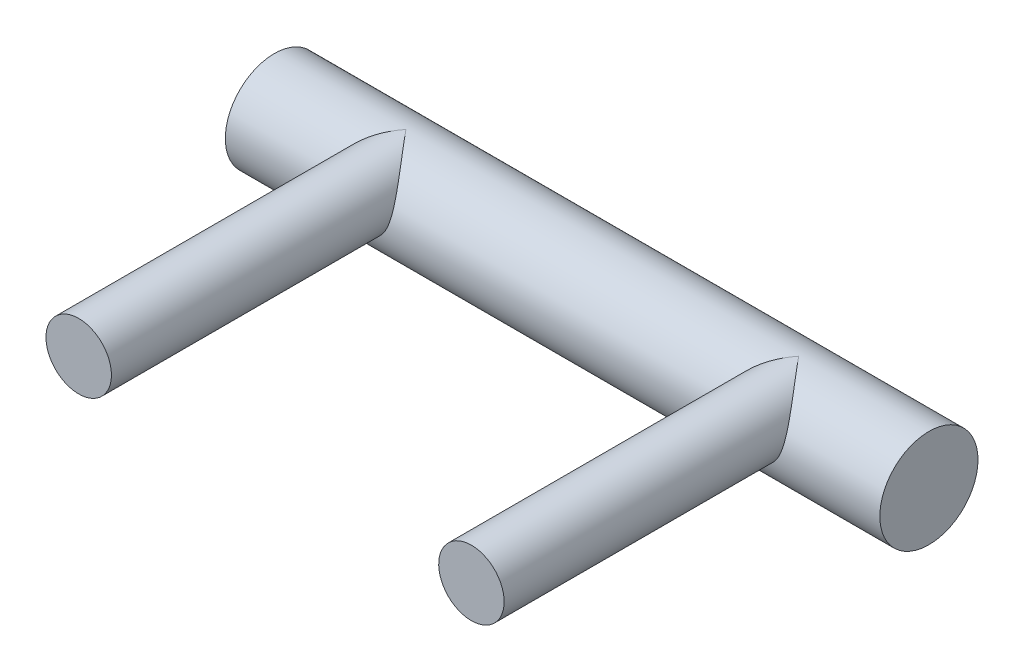
ISO-10303-21;
HEADER;
FILE_DESCRIPTION(('STEP AP214'),'2;1');
FILE_NAME('part.step','',(''),(''),'','','');
FILE_SCHEMA(('AUTOMOTIVE_DESIGN { 1 0 10303 214 1 1 1 1 }'));
ENDSEC;
DATA;
#1=APPLICATION_CONTEXT('core data for automotive mechanical design processes');
#2=APPLICATION_PROTOCOL_DEFINITION('international standard','automotive_design',2000,#1);
#3=PRODUCT_CONTEXT('',#1,'mechanical');
#4=PRODUCT('Part','Part','',(#3));
#5=PRODUCT_RELATED_PRODUCT_CATEGORY('part','',(#4));
#6=PRODUCT_DEFINITION_FORMATION('','',#4);
#7=PRODUCT_DEFINITION_CONTEXT('part definition',#1,'design');
#8=PRODUCT_DEFINITION('design','',#6,#7);
#9=PRODUCT_DEFINITION_SHAPE('','',#8);
#10=(LENGTH_UNIT() NAMED_UNIT(*) SI_UNIT(.MILLI.,.METRE.));
#11=(NAMED_UNIT(*) PLANE_ANGLE_UNIT() SI_UNIT($,.RADIAN.));
#12=(NAMED_UNIT(*) SI_UNIT($,.STERADIAN.) SOLID_ANGLE_UNIT());
#13=UNCERTAINTY_MEASURE_WITH_UNIT(LENGTH_MEASURE(1.E-05),#10,'distance_accuracy_value','');
#14=(GEOMETRIC_REPRESENTATION_CONTEXT(3) GLOBAL_UNCERTAINTY_ASSIGNED_CONTEXT((#13)) GLOBAL_UNIT_ASSIGNED_CONTEXT((#10,
#11,#12)) REPRESENTATION_CONTEXT('',''));
#15=CARTESIAN_POINT('',(0.,0.,0.));
#16=DIRECTION('',(0.,0.,1.));
#17=DIRECTION('',(1.,0.,0.));
#18=AXIS2_PLACEMENT_3D('',#15,#16,#17);
#19=CARTESIAN_POINT('',(63.5,0.,0.));
#20=DIRECTION('',(-1.,0.,0.));
#21=DIRECTION('',(0.,0.,1.));
#22=AXIS2_PLACEMENT_3D('',#19,#20,#21);
#23=CYLINDRICAL_SURFACE('',#22,9.525);
#24=CARTESIAN_POINT('',(-37.9674778593469,9.525,0.));
#25=CARTESIAN_POINT('',(-37.9677031199375,9.525,-4.75416934488494E-10));
#26=CARTESIAN_POINT('',(-37.9679283805299,9.52499998801613,0.000460241963717848));
#27=CARTESIAN_POINT('',(-37.968512491138,9.52499992587979,0.0014127522257268));
#28=CARTESIAN_POINT('',(-37.9688713459761,9.52499985730727,0.00176216329356708));
#29=CARTESIAN_POINT('',(-37.9701660853451,9.52499950010016,0.00314680505368922));
#30=CARTESIAN_POINT('',(-37.9711018599747,9.52499903491133,0.00438130152707296));
#31=CARTESIAN_POINT('',(-37.9746325799953,9.52499649926848,0.00892124826608614));
#32=CARTESIAN_POINT('',(-37.9772277406224,9.52499304501016,0.0120180190040743));
#33=CARTESIAN_POINT('',(-38.0527332341124,9.52484626134367,0.102255610762584));
#34=CARTESIAN_POINT('',(-38.1256407454377,9.52344890963461,0.193129117783091));
#35=CARTESIAN_POINT('',(-38.2720939081958,9.51811664110121,0.373693867235561));
#36=CARTESIAN_POINT('',(-38.3456390910922,9.51415790940293,0.463365868582594));
#37=CARTESIAN_POINT('',(-38.4906110968279,9.50382031799043,0.640726372479592));
#38=CARTESIAN_POINT('',(-38.5620406482669,9.49751087906986,0.728401748014186));
#39=CARTESIAN_POINT('',(-38.7045803559744,9.48247992058577,0.903299500007271));
#40=CARTESIAN_POINT('',(-38.7756908642776,9.4737644718588,0.99052246099952));
#41=CARTESIAN_POINT('',(-38.9233676164294,9.45311804671628,1.1718056489948));
#42=CARTESIAN_POINT('',(-38.9999185489236,9.44098664297923,1.26585864103564));
#43=CARTESIAN_POINT('',(-39.1527951448609,9.41387439552527,1.45383164494936));
#44=CARTESIAN_POINT('',(-39.2291206146444,9.39889157627007,1.5477515188745));
#45=CARTESIAN_POINT('',(-39.4585349133646,9.34944965457681,1.83033816690355));
#46=CARTESIAN_POINT('',(-39.611120517491,9.31062783644083,2.01867743973967));
#47=CARTESIAN_POINT('',(-39.8876603289078,9.22911895477531,2.36098516145364));
#48=CARTESIAN_POINT('',(-40.0119207755654,9.18831918476809,2.51516073799232));
#49=CARTESIAN_POINT('',(-40.2586456809145,9.09870220153422,2.82219337137813));
#50=CARTESIAN_POINT('',(-40.3811127273129,9.04989810888913,2.97505216214459));
#51=CARTESIAN_POINT('',(-40.6222910682105,8.94487917678854,3.27718713796029));
#52=CARTESIAN_POINT('',(-40.7410311426245,8.88878634380385,3.42648268416618));
#53=CARTESIAN_POINT('',(-40.9763101924549,8.76846869938415,3.72361132605213));
#54=CARTESIAN_POINT('',(-41.0928483938452,8.70424108727112,3.87144389906444));
#55=CARTESIAN_POINT('',(-41.3762685039006,8.5360543828857,4.23289238116289));
#56=CARTESIAN_POINT('',(-41.5416696241943,8.42740236735799,4.44551267522983));
#57=CARTESIAN_POINT('',(-41.8659964895574,8.19141449997597,4.86670653678669));
#58=CARTESIAN_POINT('',(-42.0248974148968,8.06401428115575,5.07526324202014));
#59=CARTESIAN_POINT('',(-42.3390627762702,7.78556106638311,5.49325273817715));
#60=CARTESIAN_POINT('',(-42.4940270631957,7.63385867713034,5.70248082506855));
#61=CARTESIAN_POINT('',(-42.7920605626346,7.30953018531255,6.11266324720032));
#62=CARTESIAN_POINT('',(-42.9351433310932,7.13692849601166,6.31362687561987));
#63=CARTESIAN_POINT('',(-43.1700470878032,6.81965588588304,6.65254062972961));
#64=CARTESIAN_POINT('',(-43.2652789435155,6.68002400947138,6.79285576386408));
#65=CARTESIAN_POINT('',(-43.4466758487381,6.3890749610151,7.06720022804113));
#66=CARTESIAN_POINT('',(-43.5328398002827,6.2377563777507,7.20122879580321));
#67=CARTESIAN_POINT('',(-43.6939315057964,5.9247218087018,7.46085246642879));
#68=CARTESIAN_POINT('',(-43.7689424466775,5.76309714527614,7.58650569999581));
#69=CARTESIAN_POINT('',(-43.9068480319816,5.42867930084521,7.82928620314386));
#70=CARTESIAN_POINT('',(-43.969746756129,5.25588990670729,7.9464163352384));
#71=CARTESIAN_POINT('',(-44.070133777866,4.93627878149907,8.14780798478716));
#72=CARTESIAN_POINT('',(-44.1101878334721,4.79140216306502,8.23388280595801));
#73=CARTESIAN_POINT('',(-44.1805142213027,4.49552352430728,8.39908179144671));
#74=CARTESIAN_POINT('',(-44.2107920155309,4.34452497757516,8.47820981888629));
#75=CARTESIAN_POINT('',(-44.2606460150991,4.03688125024541,8.62893867724202));
#76=CARTESIAN_POINT('',(-44.2802110566907,3.88023035980107,8.70053159332605));
#77=CARTESIAN_POINT('',(-44.3076575297386,3.56237934259525,8.83543318816502));
#78=CARTESIAN_POINT('',(-44.3155388537062,3.40117917399483,8.89874179070033));
#79=CARTESIAN_POINT('',(-44.3187967226575,3.07432930948008,9.01690196499753));
#80=CARTESIAN_POINT('',(-44.314088255211,2.90865687964205,9.07169338558436));
#81=CARTESIAN_POINT('',(-44.2913099511221,2.57538286275414,9.17187556634454));
#82=CARTESIAN_POINT('',(-44.2732400313009,2.40778126370104,9.21726626799354));
#83=CARTESIAN_POINT('',(-44.2233139816056,2.0723929945541,9.2984173171072));
#84=CARTESIAN_POINT('',(-44.191465455907,1.90460647738505,9.33418295884265));
#85=CARTESIAN_POINT('',(-44.1138200637838,1.57051254830925,9.39616801915291));
#86=CARTESIAN_POINT('',(-44.0680245735333,1.4042049921361,9.42238837901912));
#87=CARTESIAN_POINT('',(-43.96872783847,1.09392334163201,9.46311455506781));
#88=CARTESIAN_POINT('',(-43.916734997348,0.949594904890621,9.47862591824138));
#89=CARTESIAN_POINT('',(-43.8021804916295,0.664553309762203,9.50286573922852));
#90=CARTESIAN_POINT('',(-43.7396153269056,0.523841366502308,9.51159194533669));
#91=CARTESIAN_POINT('',(-43.604334984364,0.247194358010774,9.52279808823065));
#92=CARTESIAN_POINT('',(-43.5316231494553,0.111257737895894,9.52528007712441));
#93=CARTESIAN_POINT('',(-43.3764833960171,-0.155001628439416,9.52466969913397));
#94=CARTESIAN_POINT('',(-43.294051662395,-0.285322142731831,9.52157513658254));
#95=CARTESIAN_POINT('',(-43.1188422457189,-0.541224088546936,9.51048529958243));
#96=CARTESIAN_POINT('',(-43.025938072437,-0.666715906164841,9.50242333376738));
#97=CARTESIAN_POINT('',(-42.8312938845863,-0.910353808090843,9.48218493506996));
#98=CARTESIAN_POINT('',(-42.7295509250298,-1.02849742138444,9.47000712689698));
#99=CARTESIAN_POINT('',(-42.5178475973631,-1.25680274877878,9.44242008764053));
#100=CARTESIAN_POINT('',(-42.4078858134463,-1.36696308118135,9.42701029897401));
#101=CARTESIAN_POINT('',(-42.1803643306365,-1.578761505321,9.39386127122602));
#102=CARTESIAN_POINT('',(-42.06280406501,-1.68039896007663,9.37612185828727));
#103=CARTESIAN_POINT('',(-41.808119611665,-1.88477484138938,9.33729956455353));
#104=CARTESIAN_POINT('',(-41.6702312250107,-1.98653291611692,9.31606075634341));
#105=CARTESIAN_POINT('',(-41.3867854178453,-2.17851573774404,9.27304545432448));
#106=CARTESIAN_POINT('',(-41.2412299694837,-2.2687434302694,9.25126909954376));
#107=CARTESIAN_POINT('',(-40.9431416683947,-2.43724140502903,9.20831396074305));
#108=CARTESIAN_POINT('',(-40.7906043995569,-2.5155039794451,9.18713556902662));
#109=CARTESIAN_POINT('',(-40.4795695787596,-2.65948826028936,9.1464935130593));
#110=CARTESIAN_POINT('',(-40.3210742628921,-2.72521461648232,9.1270292144877));
#111=CARTESIAN_POINT('',(-39.9911157412223,-2.84660949142771,9.08992129650359));
#112=CARTESIAN_POINT('',(-39.8193974902322,-2.90162843803785,9.07241338219162));
#113=CARTESIAN_POINT('',(-39.4715565401396,-2.99693373602886,9.0413787188838));
#114=CARTESIAN_POINT('',(-39.2954336971421,-3.03721960541674,9.02785210013896));
#115=CARTESIAN_POINT('',(-38.940180506636,-3.10265511550174,9.00557348703849));
#116=CARTESIAN_POINT('',(-38.7610516191452,-3.12781189741453,8.99681924021575));
#117=CARTESIAN_POINT('',(-38.4011256397321,-3.16275483401868,8.98459533714581));
#118=CARTESIAN_POINT('',(-38.220328646131,-3.17254188888172,8.98112537141006));
#119=CARTESIAN_POINT('',(-37.8675245530489,-3.17654085579392,8.97971115792246));
#120=CARTESIAN_POINT('',(-37.695526521506,-3.17150162763026,8.98150122561361));
#121=CARTESIAN_POINT('',(-37.3526299186839,-3.14749940006459,8.98994073141029));
#122=CARTESIAN_POINT('',(-37.1817313153591,-3.12853680836552,8.99659002722823));
#123=CARTESIAN_POINT('',(-36.8422452270945,-3.07686675301419,9.01439180718626));
#124=CARTESIAN_POINT('',(-36.6736580505583,-3.04415747328067,9.02554488631562));
#125=CARTESIAN_POINT('',(-36.3399739232359,-2.96528699552789,9.05176346360209));
#126=CARTESIAN_POINT('',(-36.1748770316861,-2.91912556939793,9.06682902810352));
#127=CARTESIAN_POINT('',(-35.8505567020387,-2.81415377513675,9.09995407242145));
#128=CARTESIAN_POINT('',(-35.691296618543,-2.75544848416246,9.11798841166336));
#129=CARTESIAN_POINT('',(-35.3781502100257,-2.62557121768043,9.15623187182653));
#130=CARTESIAN_POINT('',(-35.2242658670408,-2.55439470101738,9.17644178390325));
#131=CARTESIAN_POINT('',(-34.9227690043688,-2.40002798513807,9.21801922625434));
#132=CARTESIAN_POINT('',(-34.7751578447059,-2.3168351978213,9.23938700529249));
#133=CARTESIAN_POINT('',(-34.4870578879431,-2.13892905459141,9.28218595515806));
#134=CARTESIAN_POINT('',(-34.3465692402083,-2.04421545721862,9.30361712730491));
#135=CARTESIAN_POINT('',(-34.0657822861678,-1.83811162004883,9.34658581027181));
#136=CARTESIAN_POINT('',(-33.9259432458971,-1.72608148573088,9.36806091025549));
#137=CARTESIAN_POINT('',(-33.6560846160064,-1.49045374009449,9.40842441443587));
#138=CARTESIAN_POINT('',(-33.5260604288301,-1.36686160626884,9.42731403316044));
#139=CARTESIAN_POINT('',(-33.276646344916,-1.10878450091816,9.46113948618486));
#140=CARTESIAN_POINT('',(-33.1572598459438,-0.974296075029734,9.47607406019321));
#141=CARTESIAN_POINT('',(-32.9301649818378,-0.695438045650404,9.50060868418107));
#142=CARTESIAN_POINT('',(-32.8224506319272,-0.551073568545289,9.51021147849318));
#143=CARTESIAN_POINT('',(-32.6225711826926,-0.257928835034865,9.52260320830493));
#144=CARTESIAN_POINT('',(-32.53003908865,-0.109407347731918,9.5255861784502));
#145=CARTESIAN_POINT('',(-32.3575584743289,0.194754302308815,9.52422263681127));
#146=CARTESIAN_POINT('',(-32.2776097692481,0.350394360458457,9.51987623267876));
#147=CARTESIAN_POINT('',(-32.1310319141729,0.667243612925545,9.50292358697095));
#148=CARTESIAN_POINT('',(-32.0643916826614,0.828448041676449,9.49032425506496));
#149=CARTESIAN_POINT('',(-31.9448475696099,1.15494151492412,9.45614417233764));
#150=CARTESIAN_POINT('',(-31.8919422388936,1.32023012647961,9.43456436967627));
#151=CARTESIAN_POINT('',(-31.8049357524065,1.63568988210337,9.38471687517149));
#152=CARTESIAN_POINT('',(-31.769444363629,1.78562840222094,9.35738798290716));
#153=CARTESIAN_POINT('',(-31.7096563944935,2.08613085045369,9.29501079821229));
#154=CARTESIAN_POINT('',(-31.6853596842959,2.23669477129484,9.2599625953198));
#155=CARTESIAN_POINT('',(-31.6477730882122,2.5372156248085,9.18217067443809));
#156=CARTESIAN_POINT('',(-31.6344843515332,2.68717249248026,9.13942615353791));
#157=CARTESIAN_POINT('',(-31.6185563117572,2.98530959051245,9.04643228147217));
#158=CARTESIAN_POINT('',(-31.6159173232338,3.1334897682639,8.99618270866699));
#159=CARTESIAN_POINT('',(-31.6207465042027,3.42480783495049,8.88932086381099));
#160=CARTESIAN_POINT('',(-31.6280620293142,3.56798811082996,8.83281661966096));
#161=CARTESIAN_POINT('',(-31.6519481142557,3.85082080306043,8.7132306361493));
#162=CARTESIAN_POINT('',(-31.6685213640756,3.99047218169689,8.65014698936494));
#163=CARTESIAN_POINT('',(-31.7102513432048,4.26537886247744,8.51794619421509));
#164=CARTESIAN_POINT('',(-31.7353991401472,4.4006385795973,8.4488353800687));
#165=CARTESIAN_POINT('',(-31.7936029864652,4.66640309741699,8.30500761885473));
#166=CARTESIAN_POINT('',(-31.8266606657813,4.79690691170216,8.2302895185093));
#167=CARTESIAN_POINT('',(-31.9157245085981,5.10759314104069,8.04261635319679));
#168=CARTESIAN_POINT('',(-31.9754942997837,5.28510070394803,7.92699592135313));
#169=CARTESIAN_POINT('',(-32.1078509409179,5.62881527727659,7.6867460376059));
#170=CARTESIAN_POINT('',(-32.1804389412979,5.79502127152861,7.5621157776658));
#171=CARTESIAN_POINT('',(-32.3373420295419,6.11718360354659,7.30401613549085));
#172=CARTESIAN_POINT('',(-32.4217521995818,6.27304000439363,7.17048021154618));
#173=CARTESIAN_POINT('',(-32.6001903191446,6.57281582091127,6.89673302042319));
#174=CARTESIAN_POINT('',(-32.6942169634832,6.71673685170664,6.75652266050177));
#175=CARTESIAN_POINT('',(-32.9304515963568,7.04897170540672,6.41216398594008));
#176=CARTESIAN_POINT('',(-33.0766983003425,7.23152412718562,6.20521096813104));
#177=CARTESIAN_POINT('',(-33.3823485389206,7.57407467014179,5.78214672406567));
#178=CARTESIAN_POINT('',(-33.5417681889135,7.73404449689834,5.56602444240974));
#179=CARTESIAN_POINT('',(-33.8655943638158,8.02713012348862,5.13387976050869));
#180=CARTESIAN_POINT('',(-34.0296683794257,8.16095190179225,4.91808425638135));
#181=CARTESIAN_POINT('',(-34.364959338867,8.40831686935109,4.48201325413232));
#182=CARTESIAN_POINT('',(-34.5361485111476,8.52193116615222,4.26175663040893));
#183=CARTESIAN_POINT('',(-34.8260693611703,8.69516446399503,3.89182645759482));
#184=CARTESIAN_POINT('',(-34.9431127372488,8.7601037664365,3.74328755635217));
#185=CARTESIAN_POINT('',(-35.179441853553,8.88175140254742,3.44471955355553));
#186=CARTESIAN_POINT('',(-35.2987267921227,8.93846261787193,3.29469099347606));
#187=CARTESIAN_POINT('',(-35.5410421319636,9.04463995801146,2.99104903289555));
#188=CARTESIAN_POINT('',(-35.6641019117777,9.09398228393092,2.83741586813364));
#189=CARTESIAN_POINT('',(-35.9120408457891,9.18458634843749,2.52881454292338));
#190=CARTESIAN_POINT('',(-36.0369226347463,9.22583480701117,2.37384461689259));
#191=CARTESIAN_POINT('',(-36.3148965731032,9.30824988375212,2.0297193933241));
#192=CARTESIAN_POINT('',(-36.468300576262,9.34750570589825,1.84035316776047));
#193=CARTESIAN_POINT('',(-36.6989571776509,9.39749894303692,1.55621786478772));
#194=CARTESIAN_POINT('',(-36.7756979752351,9.41264856830879,1.46178190815516));
#195=CARTESIAN_POINT('',(-36.9294096483946,9.44006223781837,1.27277386818249));
#196=CARTESIAN_POINT('',(-37.0063803269826,9.45232828034803,1.17820192507758));
#197=CARTESIAN_POINT('',(-37.154867979943,9.47320331227452,0.995918399526424));
#198=CARTESIAN_POINT('',(-37.2263693822915,9.48201502165478,0.908214208075952));
#199=CARTESIAN_POINT('',(-37.369694226288,9.49721171437121,0.732350395081152));
#200=CARTESIAN_POINT('',(-37.4415180258964,9.5035905583668,0.644190182997728));
#201=CARTESIAN_POINT('',(-37.5872911643054,9.51404152518121,0.465848393490937));
#202=CARTESIAN_POINT('',(-37.6612432766971,9.51804345731821,0.375679997876584));
#203=CARTESIAN_POINT('',(-37.8085072435005,9.52343339133709,0.194115069426546));
#204=CARTESIAN_POINT('',(-37.8818186214001,9.52484547623986,0.102737893964407));
#205=CARTESIAN_POINT('',(-37.9577279876668,9.52499304502841,0.0120180209483089));
#206=CARTESIAN_POINT('',(-37.960323157846,9.52499649929391,0.00892122696195135));
#207=CARTESIAN_POINT('',(-37.9638538807641,9.52499903492295,0.00438127437096119));
#208=CARTESIAN_POINT('',(-37.9647896487298,9.52499950010569,0.00314678780104024));
#209=CARTESIAN_POINT('',(-37.9660843792699,9.52499985730858,0.00176215473005573));
#210=CARTESIAN_POINT('',(-37.9664432319394,9.52499992588038,0.00141274535820088));
#211=CARTESIAN_POINT('',(-37.9670273396372,9.52499998801621,0.000460240862629553));
#212=CARTESIAN_POINT('',(-37.9672525994912,9.525,4.75415383609733E-10));
#213=CARTESIAN_POINT('',(-37.9674778593469,9.525,0.));
#214=B_SPLINE_CURVE_WITH_KNOTS('',3,(#24,#25,#26,#27,#28,#29,#30,#31,#32,#33,#34,#35,#36,#37,
#38,#39,#40,#41,#42,#43,#44,#45,#46,#47,#48,#49,#50,#51,#52,#53,#54,#55,#56,#57,#58,#59,#60,#61,
#62,#63,#64,#65,#66,#67,#68,#69,#70,#71,#72,#73,#74,#75,#76,#77,#78,#79,#80,#81,#82,#83,#84,#85,
#86,#87,#88,#89,#90,#91,#92,#93,#94,#95,#96,#97,#98,#99,#100,#101,#102,#103,#104,#105,#106,#107,
#108,#109,#110,#111,#112,#113,#114,#115,#116,#117,#118,#119,#120,#121,#122,#123,#124,#125,#126,
#127,#128,#129,#130,#131,#132,#133,#134,#135,#136,#137,#138,#139,#140,#141,#142,#143,#144,#145,
#146,#147,#148,#149,#150,#151,#152,#153,#154,#155,#156,#157,#158,#159,#160,#161,#162,#163,#164,
#165,#166,#167,#168,#169,#170,#171,#172,#173,#174,#175,#176,#177,#178,#179,#180,#181,#182,#183,
#184,#185,#186,#187,#188,#189,#190,#191,#192,#193,#194,#195,#196,#197,#198,#199,#200,#201,#202,
#203,#204,#205,#206,#207,#208,#209,#210,#211,#212,#213),.UNSPECIFIED.,.T.,.F.,(4,2,2,2,2,2,2,2,
2,2,2,2,2,2,2,2,2,2,2,2,2,2,2,2,2,2,2,2,2,2,2,2,2,2,2,2,2,2,2,2,2,2,2,2,2,2,2,2,2,2,2,2,2,2,2,2,
2,2,2,2,2,2,2,2,2,2,2,2,2,2,2,2,2,2,2,2,2,2,2,2,2,2,2,2,2,2,2,2,2,2,2,2,2,2,4),(0.,
0.0010684445786857,0.00277048513944007,0.00720968890461657,0.0195192258966796,0.365352817847043,
0.714448983170463,1.05396174859267,1.39262556524059,1.7581903388497,2.12400931384526,
2.86012872378009,3.46650370549771,4.07189448114666,4.66821364932362,5.26473868185262,
6.13544910337681,7.00922180673471,7.91226590501852,8.81426511966578,9.47275648760449,
10.1313274958887,10.7847092330436,11.4378705070117,11.9570317624423,12.4759024582211,
12.9953128444747,13.5147280092145,14.0376593614348,14.5605939690768,15.0832403455215,
15.6058351681302,16.0678571257899,16.5300323435505,16.9920556515716,17.454260912741,
17.9228110962815,18.3915179988469,18.8603058295976,19.3291286653691,19.8466046684802,
20.3639482084315,20.8816236246397,21.3991066566867,21.941912761235,22.4847366221107,
23.0273040583334,23.5698397163689,24.0854503585695,24.6010459032977,25.1167095850126,
25.6323820114474,26.1438931948392,26.6555910236736,27.1673992283252,27.6792181615917,
28.2199560388132,28.7604390266046,29.3010940348812,29.8414705027869,30.3657862288072,
30.8900942538991,31.4139638682151,31.9377781862957,32.4066548616101,32.8755260986028,
33.3444462785072,33.8133803093293,34.2752040669017,34.7371620850976,35.1986403304315,
35.6602137517525,36.3195716336009,36.9789887227715,37.6440514971959,38.3090241262695,
39.2445390705475,40.1812159398612,41.0873259528276,41.9901815242384,42.589858822839,
43.1893255918041,43.7979424014946,44.4075495992874,45.1477593420358,45.5156117346539,
45.883208453063,46.2237489541326,46.5651432117884,46.9161735485131,47.263922770224,
47.2762323526127,47.280671524766,47.2823735550275,47.2834419961207),.UNSPECIFIED.);
#215=CARTESIAN_POINT('',(-37.9674778593469,9.525,0.));
#216=VERTEX_POINT('',#215);
#217=EDGE_CURVE('E46',#216,#216,#214,.T.);
#218=ORIENTED_EDGE('',*,*,#217,.F.);
#219=EDGE_LOOP('',(#218));
#220=FACE_BOUND('',#219,.T.);
#221=CARTESIAN_POINT('',(63.5,0.,0.));
#222=DIRECTION('',(1.,0.,0.));
#223=DIRECTION('',(0.,0.,-1.));
#224=AXIS2_PLACEMENT_3D('',#221,#222,#223);
#225=CIRCLE('',#224,9.525);
#226=CARTESIAN_POINT('',(63.5,0.,-9.525));
#227=VERTEX_POINT('',#226);
#228=EDGE_CURVE('E82',#227,#227,#225,.T.);
#229=ORIENTED_EDGE('',*,*,#228,.F.);
#230=EDGE_LOOP('',(#229));
#231=FACE_BOUND('',#230,.T.);
#232=CARTESIAN_POINT('',(-63.5,0.,0.));
#233=DIRECTION('',(1.,0.,0.));
#234=DIRECTION('',(0.,0.,-1.));
#235=AXIS2_PLACEMENT_3D('',#232,#233,#234);
#236=CIRCLE('',#235,9.525);
#237=CARTESIAN_POINT('',(-63.5,0.,-9.525));
#238=VERTEX_POINT('',#237);
#239=EDGE_CURVE('E85',#238,#238,#236,.T.);
#240=ORIENTED_EDGE('',*,*,#239,.T.);
#241=EDGE_LOOP('',(#240));
#242=FACE_BOUND('',#241,.T.);
#243=CARTESIAN_POINT('',(38.2325221406531,9.52500000000001,0.));
#244=CARTESIAN_POINT('',(38.2322968800301,9.52500000000001,-4.74981253360253E-10));
#245=CARTESIAN_POINT('',(38.2320716194059,9.52499998801614,0.000460241930443009));
#246=CARTESIAN_POINT('',(38.2314875087728,9.52499992587979,0.00141275215214757));
#247=CARTESIAN_POINT('',(38.2311286539715,9.52499985730728,0.00176216325558808));
#248=CARTESIAN_POINT('',(38.2298339146861,9.52499950010017,0.00314680509824516));
#249=CARTESIAN_POINT('',(38.2288981400297,9.52499903491133,0.00438130154005174));
#250=CARTESIAN_POINT('',(38.2253674199445,9.52499649926849,0.00892124820382223));
#251=CARTESIAN_POINT('',(38.2227722593465,9.52499304501016,0.0120180189723124));
#252=CARTESIAN_POINT('',(38.147266766608,9.52484626134357,0.102255611619715));
#253=CARTESIAN_POINT('',(38.0743592546984,9.52344890963333,0.193129118084086));
#254=CARTESIAN_POINT('',(37.9279060915339,9.51811664109768,0.373693867093356));
#255=CARTESIAN_POINT('',(37.854360908822,9.51415790940065,0.463365868562369));
#256=CARTESIAN_POINT('',(37.7093889032175,9.50382031798994,0.640726372545449));
#257=CARTESIAN_POINT('',(37.6379593517303,9.49751087906839,0.728401748050093));
#258=CARTESIAN_POINT('',(37.4954196439588,9.48247992057992,0.903299500056546));
#259=CARTESIAN_POINT('',(37.4243091356397,9.473764471849,0.990522461091928));
#260=CARTESIAN_POINT('',(37.27663238347,9.45311804670034,1.17180564912801));
#261=CARTESIAN_POINT('',(37.2000814509729,9.440986642962,1.26585864116542));
#262=CARTESIAN_POINT('',(37.0472048550386,9.41387439550634,1.45383164507031));
#263=CARTESIAN_POINT('',(36.9708793852609,9.39889157625091,1.54775151899006));
#264=CARTESIAN_POINT('',(36.7414650865645,9.34944965455907,1.83033816699278));
#265=CARTESIAN_POINT('',(36.588879482455,9.31062783642585,2.01867743980687));
#266=CARTESIAN_POINT('',(36.3123396710547,9.22911895476347,2.36098516149982));
#267=CARTESIAN_POINT('',(36.1880792243968,9.18831918475526,2.5151607380392));
#268=CARTESIAN_POINT('',(35.9413543190446,9.09870220151846,2.82219337142923));
#269=CARTESIAN_POINT('',(35.8188872726434,9.04989810887125,2.9750521621992));
#270=CARTESIAN_POINT('',(35.5777089317374,8.94487917676471,3.27718713802571));
#271=CARTESIAN_POINT('',(35.4589688573177,8.88878634377598,3.42648268423887));
#272=CARTESIAN_POINT('',(35.2236898074769,8.76846869934766,3.72361132613838));
#273=CARTESIAN_POINT('',(35.1071516060819,8.7042410872301,3.871443899157));
#274=CARTESIAN_POINT('',(34.8237314960248,8.53605438283822,4.23289238125851));
#275=CARTESIAN_POINT('',(34.658330375734,8.42740236730916,4.4455126753223));
#276=CARTESIAN_POINT('',(34.3340035103782,8.1914144999258,4.86670653687093));
#277=CARTESIAN_POINT('',(34.1751025850431,8.06401428110576,5.07526324209935));
#278=CARTESIAN_POINT('',(33.8609372236794,7.78556106633507,5.49325273824495));
#279=CARTESIAN_POINT('',(33.7059729367591,7.63385867708422,5.70248082512999));
#280=CARTESIAN_POINT('',(33.40793943733,7.30953018527092,6.11266324724985));
#281=CARTESIAN_POINT('',(33.2648566688758,7.13692849597256,6.31362687566382));
#282=CARTESIAN_POINT('',(33.0299529121711,6.81965588584631,6.65254062976726));
#283=CARTESIAN_POINT('',(32.9347210564597,6.68002400943403,6.79285576390081));
#284=CARTESIAN_POINT('',(32.7533241512394,6.38907496097665,7.06720022807588));
#285=CARTESIAN_POINT('',(32.6671601996959,6.23775637771179,7.20122879583691));
#286=CARTESIAN_POINT('',(32.5060684941843,5.92472180866167,7.46085246646066));
#287=CARTESIAN_POINT('',(32.4310575533043,5.76309714523523,7.58650570002689));
#288=CARTESIAN_POINT('',(32.2931519680023,5.42867930080279,7.82928620317328));
#289=CARTESIAN_POINT('',(32.2302532438561,5.25588990666415,7.94641633526693));
#290=CARTESIAN_POINT('',(32.1298662221213,4.93627878145517,8.14780798481374));
#291=CARTESIAN_POINT('',(32.0898121665164,4.79140216302111,8.23388280598355));
#292=CARTESIAN_POINT('',(32.019485778688,4.49552352426343,8.39908179147017));
#293=CARTESIAN_POINT('',(31.9892079844609,4.34452497753141,8.4782098189087));
#294=CARTESIAN_POINT('',(31.939353984895,4.03688125020206,8.62893867726228));
#295=CARTESIAN_POINT('',(31.9197889433045,3.88023035975804,8.70053159334523));
#296=CARTESIAN_POINT('',(31.8923424702588,3.56237934255298,8.83543318818204));
#297=CARTESIAN_POINT('',(31.8844611462924,3.40117917395303,8.8987417907163));
#298=CARTESIAN_POINT('',(31.8812032773432,3.07432930943933,9.01690196501141));
#299=CARTESIAN_POINT('',(31.8859117447907,2.9086568796019,9.07169338559722));
#300=CARTESIAN_POINT('',(31.9086900488816,2.57538286271533,9.17187556635542));
#301=CARTESIAN_POINT('',(31.9267599687038,2.40778126366298,9.21726626800346));
#302=CARTESIAN_POINT('',(31.9766860184009,2.07239299451763,9.29841731711531));
#303=CARTESIAN_POINT('',(32.0085345441003,1.90460647734941,9.3341829588499));
#304=CARTESIAN_POINT('',(32.0861799362251,1.57051254827541,9.39616801915854));
#305=CARTESIAN_POINT('',(32.1319754264763,1.40420499210321,9.422388379024));
#306=CARTESIAN_POINT('',(32.2312721615409,1.09392334160049,9.46311455507144));
#307=CARTESIAN_POINT('',(32.2832650026637,0.949594904859512,9.47862591824449));
#308=CARTESIAN_POINT('',(32.3978195083836,0.664553309731995,9.50286573923063));
#309=CARTESIAN_POINT('',(32.4603846731081,0.523841366472584,9.51159194533832));
#310=CARTESIAN_POINT('',(32.5956650156509,0.247194357982084,9.52279808823139));
#311=CARTESIAN_POINT('',(32.6683768505602,0.111257737867753,9.52528007712473));
#312=CARTESIAN_POINT('',(32.8235166039995,-0.155001628466414,9.52466969913352));
#313=CARTESIAN_POINT('',(32.9059483376222,-0.285322142758237,9.52157513658174));
#314=CARTESIAN_POINT('',(33.0811577542996,-0.541224088572463,9.51048529958097));
#315=CARTESIAN_POINT('',(33.1740619275822,-0.666715906190063,9.50242333376561));
#316=CARTESIAN_POINT('',(33.3687061154343,-0.910353808115393,9.4821849350676));
#317=CARTESIAN_POINT('',(33.4704490749915,-1.02849742140863,9.47000712689435));
#318=CARTESIAN_POINT('',(33.6821524026597,-1.25680274880217,9.44242008763741));
#319=CARTESIAN_POINT('',(33.7921141865772,-1.3669630812043,9.42701029897067));
#320=CARTESIAN_POINT('',(34.0196356693884,-1.57876150534304,9.39386127122231));
#321=CARTESIAN_POINT('',(34.1371959350156,-1.68039896009819,9.3761218582834));
#322=CARTESIAN_POINT('',(34.391880388362,-1.88477484140988,9.33729956454939));
#323=CARTESIAN_POINT('',(34.5297687750171,-1.98653291613685,9.31606075633916));
#324=CARTESIAN_POINT('',(34.813214582184,-2.17851573776274,9.27304545432008));
#325=CARTESIAN_POINT('',(34.9587700305464,-2.26874343028745,9.25126909953932));
#326=CARTESIAN_POINT('',(35.2568583316367,-2.43724140504569,9.20831396073863));
#327=CARTESIAN_POINT('',(35.4093956004752,-2.51550397946104,9.18713556902225));
#328=CARTESIAN_POINT('',(35.7204304212739,-2.65948826030378,9.1464935130551));
#329=CARTESIAN_POINT('',(35.8789257371421,-2.72521461649594,9.12702921448362));
#330=CARTESIAN_POINT('',(36.2088842588128,-2.8466094914395,9.08992129649989));
#331=CARTESIAN_POINT('',(36.3806025098032,-2.90162843804863,9.07241338218816));
#332=CARTESIAN_POINT('',(36.7284434598963,-2.99693373603761,9.04137871888089));
#333=CARTESIAN_POINT('',(36.9045663028941,-3.03721960542445,9.02785210013636));
#334=CARTESIAN_POINT('',(37.2598194934005,-3.10265511550738,9.00557348703654));
#335=CARTESIAN_POINT('',(37.4389483808914,-3.12781189741913,8.99681924021415));
#336=CARTESIAN_POINT('',(37.7988743603047,-3.16275483402118,8.98459533714493));
#337=CARTESIAN_POINT('',(37.9796713539058,-3.17254188888318,8.98112537140955));
#338=CARTESIAN_POINT('',(38.3324754469878,-3.17654085579333,8.97971115792267));
#339=CARTESIAN_POINT('',(38.5044734785304,-3.17150162762868,8.98150122561417));
#340=CARTESIAN_POINT('',(38.847370081352,-3.14749940006108,8.98994073141153));
#341=CARTESIAN_POINT('',(39.0182686846765,-3.12853680836106,8.99659002722978));
#342=CARTESIAN_POINT('',(39.3577547729405,-3.07686675300788,9.01439180718842));
#343=CARTESIAN_POINT('',(39.5263419494763,-3.04415747327345,9.02554488631806));
#344=CARTESIAN_POINT('',(39.8600260767979,-2.96528699551891,9.05176346360504));
#345=CARTESIAN_POINT('',(40.0251229683473,-2.91912556938809,9.0668290281067));
#346=CARTESIAN_POINT('',(40.349443297994,-2.81415377512516,9.09995407242504));
#347=CARTESIAN_POINT('',(40.5087033814895,-2.75544848414996,9.11798841166714));
#348=CARTESIAN_POINT('',(40.8218497900063,-2.62557121766612,9.15623187183064));
#349=CARTESIAN_POINT('',(40.9757341329909,-2.55439470100217,9.17644178390749));
#350=CARTESIAN_POINT('',(41.2772309956623,-2.40002798512108,9.21801922625877));
#351=CARTESIAN_POINT('',(41.4248421553249,-2.31683519780343,9.23938700529698));
#352=CARTESIAN_POINT('',(41.7129421120869,-2.13892905457178,9.28218595516259));
#353=CARTESIAN_POINT('',(41.8534307598212,-2.04421545719812,9.30361712730943));
#354=CARTESIAN_POINT('',(42.1342177138608,-1.83811162002658,9.3465858102762));
#355=CARTESIAN_POINT('',(42.2740567541309,-1.72608148570776,9.36806091025976));
#356=CARTESIAN_POINT('',(42.5439153840205,-1.49045374006965,9.40842441443981));
#357=CARTESIAN_POINT('',(42.6739395711962,-1.36686160624316,9.42731403316418));
#358=CARTESIAN_POINT('',(42.9233536551089,-1.10878450089085,9.46113948618807));
#359=CARTESIAN_POINT('',(43.0427401540804,-0.974296075001626,9.47607406019611));
#360=CARTESIAN_POINT('',(43.2698350181849,-0.695438045620767,9.50060868418325));
#361=CARTESIAN_POINT('',(43.3775493680948,-0.551073568514916,9.51021147849496));
#362=CARTESIAN_POINT('',(43.5774288173276,-0.257928835003441,9.52260320830579));
#363=CARTESIAN_POINT('',(43.6699609113691,-0.109407347700198,9.52558617845057));
#364=CARTESIAN_POINT('',(43.8424415256882,0.194754302341015,9.52422263681061));
#365=CARTESIAN_POINT('',(43.922390230768,0.350394360490838,9.51987623267757));
#366=CARTESIAN_POINT('',(44.0689680858411,0.667243612958177,9.50292358696866));
#367=CARTESIAN_POINT('',(44.1356083173516,0.828448041709152,9.49032425506211));
#368=CARTESIAN_POINT('',(44.2551524304011,1.15494151495683,9.45614417233365));
#369=CARTESIAN_POINT('',(44.3080577611164,1.32023012651226,9.4345643696717));
#370=CARTESIAN_POINT('',(44.3950642476016,1.63568988213582,9.38471687516584));
#371=CARTESIAN_POINT('',(44.4305556363782,1.78562840225326,9.357387982901));
#372=CARTESIAN_POINT('',(44.490343605512,2.08613085048566,9.29501079820512));
#373=CARTESIAN_POINT('',(44.5146403157088,2.23669477132659,9.25996259531213));
#374=CARTESIAN_POINT('',(44.5522269117909,2.53721562483971,9.18217067442947));
#375=CARTESIAN_POINT('',(44.5655156484692,2.68717249251115,9.13942615352882));
#376=CARTESIAN_POINT('',(44.5814436882437,2.98530959054262,9.04643228146221));
#377=CARTESIAN_POINT('',(44.5840826767664,3.13348976829368,8.99618270865661));
#378=CARTESIAN_POINT('',(44.5792534957962,3.4248078349798,8.8893208637997));
#379=CARTESIAN_POINT('',(44.571937970684,3.56798811085917,8.83281661964916));
#380=CARTESIAN_POINT('',(44.5480518857412,3.8508208030894,8.7132306361365));
#381=CARTESIAN_POINT('',(44.5314786359207,3.9904721817257,8.65014698935165));
#382=CARTESIAN_POINT('',(44.4897486567902,4.26537886250597,8.51794619420081));
#383=CARTESIAN_POINT('',(44.4646008598472,4.40063857962568,8.44883538005392));
#384=CARTESIAN_POINT('',(44.406397013528,4.66640309744505,8.30500761883896));
#385=CARTESIAN_POINT('',(44.3733393342113,4.79690691173004,8.23028951849305));
#386=CARTESIAN_POINT('',(44.284275491393,5.10759314106881,8.04261635317896));
#387=CARTESIAN_POINT('',(44.2245057002063,5.28510070397652,7.92699592133416));
#388=CARTESIAN_POINT('',(44.0921490590699,5.62881527730566,7.68674603758463));
#389=CARTESIAN_POINT('',(44.0195610586888,5.7950212715579,7.56211577764338));
#390=CARTESIAN_POINT('',(43.8626579704429,6.11718360357582,7.30401613546638));
#391=CARTESIAN_POINT('',(43.778247800402,6.27304000442261,7.17048021152084));
#392=CARTESIAN_POINT('',(43.5998096808374,6.57281582093977,6.89673302039604));
#393=CARTESIAN_POINT('',(43.5057830364978,6.7167368517349,6.75652266047368));
#394=CARTESIAN_POINT('',(43.2695484036222,7.048971705434,6.4121639859101));
#395=CARTESIAN_POINT('',(43.1233016996355,7.23152412721216,6.20521096810011));
#396=CARTESIAN_POINT('',(42.8176514610558,7.57407467016636,5.78214672403347));
#397=CARTESIAN_POINT('',(42.6582318110624,7.73404449692172,5.56602444237724));
#398=CARTESIAN_POINT('',(42.3344056361584,8.02713012351047,5.13387976047458));
#399=CARTESIAN_POINT('',(42.1703316205472,8.16095190181363,4.9180842563459));
#400=CARTESIAN_POINT('',(41.835040661102,8.40831686937253,4.48201325409227));
#401=CARTESIAN_POINT('',(41.6638514888186,8.521931166174,4.26175663036556));
#402=CARTESIAN_POINT('',(41.3739306387917,8.6951644640167,3.89182645754649));
#403=CARTESIAN_POINT('',(41.2568872627118,8.76010376645788,3.74328755630221));
#404=CARTESIAN_POINT('',(41.0205581464041,8.88175140256842,3.44471955350146));
#405=CARTESIAN_POINT('',(40.9012732078323,8.93846261789281,3.29469099341951));
#406=CARTESIAN_POINT('',(40.6589578679905,9.04463995803043,2.99104903283809));
#407=CARTESIAN_POINT('',(40.5358980881775,9.09398228394833,2.83741586807778));
#408=CARTESIAN_POINT('',(40.2879591541712,9.18458634845101,2.52881454287389));
#409=CARTESIAN_POINT('',(40.163077365218,9.22583480702253,2.3738446168479));
#410=CARTESIAN_POINT('',(39.8851034268884,9.30824988375367,2.02971939331433));
#411=CARTESIAN_POINT('',(39.7316994237531,9.34750570589375,1.84035316778116));
#412=CARTESIAN_POINT('',(39.5010428223977,9.39749894302702,1.55621786484645));
#413=CARTESIAN_POINT('',(39.4243020248222,9.412648568298,1.46178190822263));
#414=CARTESIAN_POINT('',(39.270590351671,9.44006223780725,1.27277386826599));
#415=CARTESIAN_POINT('',(39.1936196730827,9.4523282803373,1.17820192516835));
#416=CARTESIAN_POINT('',(39.0451320201098,9.47320331226857,0.99591839958115));
#417=CARTESIAN_POINT('',(38.9736306177481,9.48201502165227,0.908214208088547));
#418=CARTESIAN_POINT('',(38.830305773687,9.4972117143722,0.732350395086162));
#419=CARTESIAN_POINT('',(38.7584819740272,9.50359055836839,0.64419018303748));
#420=CARTESIAN_POINT('',(38.6127088357661,9.51404152518011,0.465848393440824));
#421=CARTESIAN_POINT('',(38.5387567235797,9.51804345731543,0.375679997695443));
#422=CARTESIAN_POINT('',(38.3914927563309,9.523433391336,0.194115069734225));
#423=CARTESIAN_POINT('',(38.318181377788,9.52484547623985,0.10273789488234));
#424=CARTESIAN_POINT('',(38.2422720123669,9.52499304502841,0.0120180209145787));
#425=CARTESIAN_POINT('',(38.2396768422198,9.52499649929391,0.00892122689539678));
#426=CARTESIAN_POINT('',(38.2361461192289,9.52499903492295,0.0043812743858432));
#427=CARTESIAN_POINT('',(38.2352103512331,9.5249995001057,0.00314678785006168));
#428=CARTESIAN_POINT('',(38.2339156207819,9.52499985730859,0.00176215469321322));
#429=CARTESIAN_POINT('',(38.233556768152,9.52499992588038,0.00141274528421819));
#430=CARTESIAN_POINT('',(38.2329726604287,9.52499998801621,0.000460240828653494));
#431=CARTESIAN_POINT('',(38.2327474005415,9.52500000000001,4.7497970444006E-10));
#432=CARTESIAN_POINT('',(38.2325221406531,9.52500000000001,0.));
#433=B_SPLINE_CURVE_WITH_KNOTS('',3,(#243,#244,#245,#246,#247,#248,#249,#250,#251,#252,#253,
#254,#255,#256,#257,#258,#259,#260,#261,#262,#263,#264,#265,#266,#267,#268,#269,#270,#271,#272,
#273,#274,#275,#276,#277,#278,#279,#280,#281,#282,#283,#284,#285,#286,#287,#288,#289,#290,#291,
#292,#293,#294,#295,#296,#297,#298,#299,#300,#301,#302,#303,#304,#305,#306,#307,#308,#309,#310,
#311,#312,#313,#314,#315,#316,#317,#318,#319,#320,#321,#322,#323,#324,#325,#326,#327,#328,#329,
#330,#331,#332,#333,#334,#335,#336,#337,#338,#339,#340,#341,#342,#343,#344,#345,#346,#347,#348,
#349,#350,#351,#352,#353,#354,#355,#356,#357,#358,#359,#360,#361,#362,#363,#364,#365,#366,#367,
#368,#369,#370,#371,#372,#373,#374,#375,#376,#377,#378,#379,#380,#381,#382,#383,#384,#385,#386,
#387,#388,#389,#390,#391,#392,#393,#394,#395,#396,#397,#398,#399,#400,#401,#402,#403,#404,#405,
#406,#407,#408,#409,#410,#411,#412,#413,#414,#415,#416,#417,#418,#419,#420,#421,#422,#423,#424,
#425,#426,#427,#428,#429,#430,#431,#432),.UNSPECIFIED.,.T.,.F.,(4,2,2,2,2,2,2,2,2,2,2,2,2,2,2,2,
2,2,2,2,2,2,2,2,2,2,2,2,2,2,2,2,2,2,2,2,2,2,2,2,2,2,2,2,2,2,2,2,2,2,2,2,2,2,2,2,2,2,2,2,2,2,2,2,
2,2,2,2,2,2,2,2,2,2,2,2,2,2,2,2,2,2,2,2,2,2,2,2,2,2,2,2,2,2,4),(0.,0.00106844459214641,
0.00277048514469367,0.00720968890661351,0.0195192258966811,0.365352818004582,0.714448983166616,
1.05396174863463,1.39262556540729,1.75819033901629,2.12400931398799,2.86012872383997,
3.46650370556021,4.07189448122372,4.66821364943051,5.26473868198627,6.13544910350012,
7.00922180683993,7.9122659050996,8.814265119725,9.47275648766181,10.1313274959437,
10.7847092330979,11.4378705070653,11.9570317624937,12.4759024582702,12.9953128445212,
13.5147280092584,14.0376593614762,14.5605939691155,15.0832403455578,15.605835168164,
16.0678571258231,16.5300323435831,16.9920556516036,17.4542609127724,17.9228110963135,
18.3915179988796,18.8603058296309,19.329128665403,19.846604668515,20.3639482084671,
20.8816236246762,21.399106656724,21.9419127612722,22.4847366221477,23.0273040583703,
23.5698397164057,24.0854503586058,24.6010459033336,25.1167095850479,25.6323820114822,
26.1438931948744,26.6555910237092,27.1673992283612,27.6792181616281,28.2199560388499,
28.7604390266416,29.3010940349186,29.8414705028245,30.365786228844,30.890094253935,
31.4139638682501,31.9377781863299,32.4066548616436,32.8755260986356,33.3444462785393,
33.8133803093606,34.2752040669334,34.7371620851297,35.1986403304643,35.6602137517858,
36.3195716336378,36.9789887228119,37.6440514972384,38.3090241263145,39.2445390705945,
40.1812159399078,41.0873259528785,41.9901815243016,42.5898588229081,43.1893255918823,
43.7979424015661,44.4075495993391,45.1477593419714,45.5156117345521,45.8832084529472,
46.2237489541341,46.5651432118302,46.9161735483773,47.2639227702241,47.2762323526108,
47.2806715247608,47.2823735550129,47.2834419961208),.UNSPECIFIED.);
#434=CARTESIAN_POINT('',(38.2325221406531,9.525,0.));
#435=VERTEX_POINT('',#434);
#436=EDGE_CURVE('E11',#435,#435,#433,.T.);
#437=ORIENTED_EDGE('',*,*,#436,.F.);
#438=EDGE_LOOP('',(#437));
#439=FACE_BOUND('',#438,.T.);
#440=ADVANCED_FACE('F33',(#220,#231,#242,#439),#23,.T.);
#441=CARTESIAN_POINT('',(63.5,0.,0.));
#442=DIRECTION('',(1.,0.,0.));
#443=DIRECTION('',(0.,0.,-1.));
#444=AXIS2_PLACEMENT_3D('',#441,#442,#443);
#445=PLANE('',#444);
#446=ORIENTED_EDGE('',*,*,#228,.T.);
#447=EDGE_LOOP('',(#446));
#448=FACE_BOUND('',#447,.T.);
#449=ADVANCED_FACE('F71',(#448),#445,.T.);
#450=CARTESIAN_POINT('',(-63.5,0.,0.));
#451=DIRECTION('',(1.,0.,0.));
#452=DIRECTION('',(0.,0.,-1.));
#453=AXIS2_PLACEMENT_3D('',#450,#451,#452);
#454=PLANE('',#453);
#455=ORIENTED_EDGE('',*,*,#239,.F.);
#456=EDGE_LOOP('',(#455));
#457=FACE_BOUND('',#456,.T.);
#458=ADVANCED_FACE('F75',(#457),#454,.F.);
#459=CARTESIAN_POINT('',(-37.9674778593469,3.175,63.5));
#460=DIRECTION('',(0.,0.,-1.));
#461=DIRECTION('',(-1.,0.,0.));
#462=AXIS2_PLACEMENT_3D('',#459,#460,#461);
#463=CYLINDRICAL_SURFACE('',#462,6.35);
#464=CARTESIAN_POINT('',(-37.9674778593469,3.175,63.5));
#465=DIRECTION('',(0.,0.,1.));
#466=DIRECTION('',(1.,0.,0.));
#467=AXIS2_PLACEMENT_3D('',#464,#465,#466);
#468=CIRCLE('',#467,6.35);
#469=CARTESIAN_POINT('',(-31.6174778593469,3.175,63.5));
#470=VERTEX_POINT('',#469);
#471=EDGE_CURVE('E87',#470,#470,#468,.T.);
#472=ORIENTED_EDGE('',*,*,#471,.F.);
#473=EDGE_LOOP('',(#472));
#474=FACE_BOUND('',#473,.T.);
#475=ORIENTED_EDGE('',*,*,#217,.T.);
#476=EDGE_LOOP('',(#475));
#477=FACE_BOUND('',#476,.T.);
#478=ADVANCED_FACE('F65',(#474,#477),#463,.T.);
#479=CARTESIAN_POINT('',(-37.9674778593469,3.175,63.5));
#480=DIRECTION('',(0.,0.,1.));
#481=DIRECTION('',(1.,0.,0.));
#482=AXIS2_PLACEMENT_3D('',#479,#480,#481);
#483=PLANE('',#482);
#484=ORIENTED_EDGE('',*,*,#471,.T.);
#485=EDGE_LOOP('',(#484));
#486=FACE_BOUND('',#485,.T.);
#487=ADVANCED_FACE('F57',(#486),#483,.T.);
#488=CARTESIAN_POINT('',(38.2325221406531,3.17500000000001,63.5));
#489=DIRECTION('',(0.,0.,-1.));
#490=DIRECTION('',(-1.,0.,0.));
#491=AXIS2_PLACEMENT_3D('',#488,#489,#490);
#492=CYLINDRICAL_SURFACE('',#491,6.35);
#493=CARTESIAN_POINT('',(38.2325221406531,3.17500000000001,63.5));
#494=DIRECTION('',(0.,0.,1.));
#495=DIRECTION('',(1.,0.,0.));
#496=AXIS2_PLACEMENT_3D('',#493,#494,#495);
#497=CIRCLE('',#496,6.35);
#498=CARTESIAN_POINT('',(44.5825221406531,3.17500000000001,63.5));
#499=VERTEX_POINT('',#498);
#500=EDGE_CURVE('E91',#499,#499,#497,.T.);
#501=ORIENTED_EDGE('',*,*,#500,.F.);
#502=EDGE_LOOP('',(#501));
#503=FACE_BOUND('',#502,.T.);
#504=ORIENTED_EDGE('',*,*,#436,.T.);
#505=EDGE_LOOP('',(#504));
#506=FACE_BOUND('',#505,.T.);
#507=ADVANCED_FACE('F54',(#503,#506),#492,.T.);
#508=CARTESIAN_POINT('',(38.2325221406531,3.17500000000001,63.5));
#509=DIRECTION('',(0.,0.,1.));
#510=DIRECTION('',(1.,0.,0.));
#511=AXIS2_PLACEMENT_3D('',#508,#509,#510);
#512=PLANE('',#511);
#513=ORIENTED_EDGE('',*,*,#500,.T.);
#514=EDGE_LOOP('',(#513));
#515=FACE_BOUND('',#514,.T.);
#516=ADVANCED_FACE('F56',(#515),#512,.T.);
#517=CLOSED_SHELL('',(#440,#449,#458,#478,#487,#507,#516));
#518=MANIFOLD_SOLID_BREP('B2',#517);
#519=ADVANCED_BREP_SHAPE_REPRESENTATION('',(#18,#518),#14);
#520=SHAPE_DEFINITION_REPRESENTATION(#9,#519);
ENDSEC;
END-ISO-10303-21;
